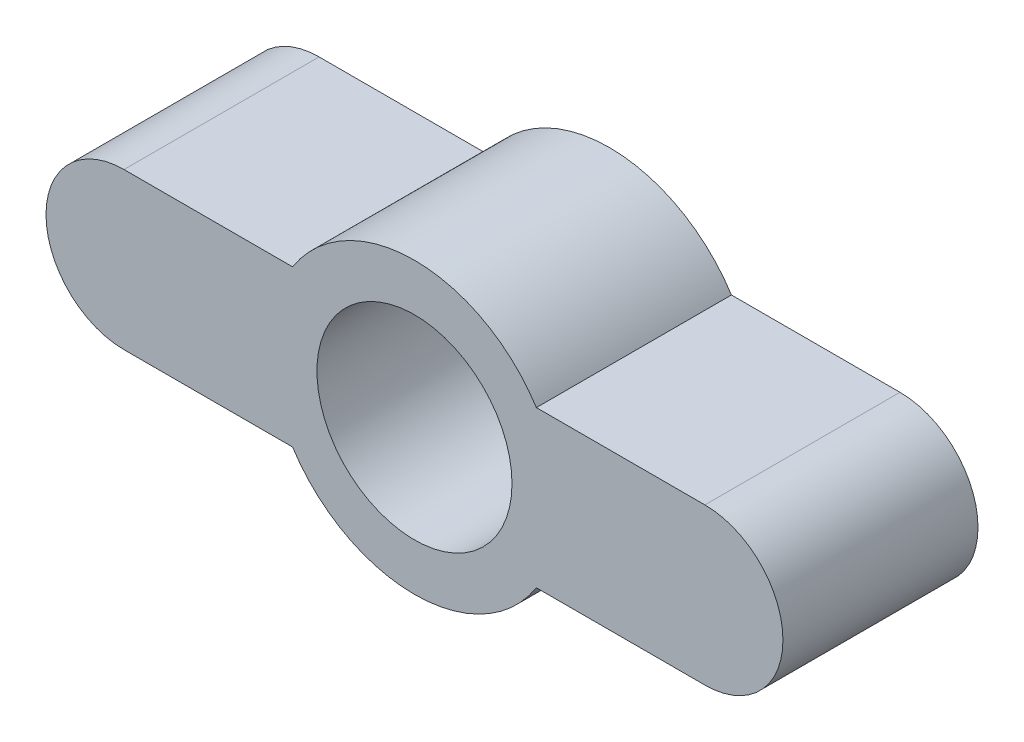
ISO-10303-21;
HEADER;
FILE_DESCRIPTION(('STEP AP214'),'2;1');
FILE_NAME('part.step','',(''),(''),'','','');
FILE_SCHEMA(('AUTOMOTIVE_DESIGN { 1 0 10303 214 1 1 1 1 }'));
ENDSEC;
DATA;
#1=APPLICATION_CONTEXT('core data for automotive mechanical design processes');
#2=APPLICATION_PROTOCOL_DEFINITION('international standard','automotive_design',2000,#1);
#3=PRODUCT_CONTEXT('',#1,'mechanical');
#4=PRODUCT('Part','Part','',(#3));
#5=PRODUCT_RELATED_PRODUCT_CATEGORY('part','',(#4));
#6=PRODUCT_DEFINITION_FORMATION('','',#4);
#7=PRODUCT_DEFINITION_CONTEXT('part definition',#1,'design');
#8=PRODUCT_DEFINITION('design','',#6,#7);
#9=PRODUCT_DEFINITION_SHAPE('','',#8);
#10=(LENGTH_UNIT() NAMED_UNIT(*) SI_UNIT(.MILLI.,.METRE.));
#11=(NAMED_UNIT(*) PLANE_ANGLE_UNIT() SI_UNIT($,.RADIAN.));
#12=(NAMED_UNIT(*) SI_UNIT($,.STERADIAN.) SOLID_ANGLE_UNIT());
#13=UNCERTAINTY_MEASURE_WITH_UNIT(LENGTH_MEASURE(1.E-05),#10,'distance_accuracy_value','');
#14=(GEOMETRIC_REPRESENTATION_CONTEXT(3) GLOBAL_UNCERTAINTY_ASSIGNED_CONTEXT((#13)) GLOBAL_UNIT_ASSIGNED_CONTEXT((#10,
#11,#12)) REPRESENTATION_CONTEXT('',''));
#15=CARTESIAN_POINT('',(0.,0.,0.));
#16=DIRECTION('',(0.,0.,1.));
#17=DIRECTION('',(1.,0.,0.));
#18=AXIS2_PLACEMENT_3D('',#15,#16,#17);
#19=CARTESIAN_POINT('',(0.,0.,5.));
#20=DIRECTION('',(0.,0.,1.));
#21=DIRECTION('',(1.,0.,0.));
#22=AXIS2_PLACEMENT_3D('',#19,#20,#21);
#23=PLANE('',#22);
#24=CARTESIAN_POINT('',(0.,0.,5.));
#25=DIRECTION('',(0.,0.,1.));
#26=DIRECTION('',(1.,0.,0.));
#27=AXIS2_PLACEMENT_3D('',#24,#25,#26);
#28=CIRCLE('',#27,3.71000000000001);
#29=CARTESIAN_POINT('',(-3.1247559904735,-2.00000000000001,5.));
#30=VERTEX_POINT('',#29);
#31=CARTESIAN_POINT('',(3.1247559904735,-2.00000000000001,5.));
#32=VERTEX_POINT('',#31);
#33=EDGE_CURVE('E167',#30,#32,#28,.T.);
#34=ORIENTED_EDGE('',*,*,#33,.T.);
#35=DIRECTION('',(1.,0.,0.));
#36=VECTOR('',#35,1.);
#37=CARTESIAN_POINT('',(3.1247559904735,-2.00000000000001,5.));
#38=LINE('',#37,#36);
#39=CARTESIAN_POINT('',(7.44499999999999,-2.00000000000001,5.));
#40=VERTEX_POINT('',#39);
#41=EDGE_CURVE('E103',#32,#40,#38,.T.);
#42=ORIENTED_EDGE('',*,*,#41,.T.);
#43=CARTESIAN_POINT('',(7.44499999999999,0.,5.));
#44=DIRECTION('',(0.,0.,1.));
#45=DIRECTION('',(1.,0.,0.));
#46=AXIS2_PLACEMENT_3D('',#43,#44,#45);
#47=CIRCLE('',#46,2.);
#48=CARTESIAN_POINT('',(7.44499999999999,1.99999999999999,5.));
#49=VERTEX_POINT('',#48);
#50=EDGE_CURVE('E188',#40,#49,#47,.T.);
#51=ORIENTED_EDGE('',*,*,#50,.T.);
#52=DIRECTION('',(-1.,0.,0.));
#53=VECTOR('',#52,1.);
#54=CARTESIAN_POINT('',(3.1247559904735,1.99999999999999,5.));
#55=LINE('',#54,#53);
#56=CARTESIAN_POINT('',(3.1247559904735,1.99999999999999,5.));
#57=VERTEX_POINT('',#56);
#58=EDGE_CURVE('E202',#49,#57,#55,.T.);
#59=ORIENTED_EDGE('',*,*,#58,.T.);
#60=CARTESIAN_POINT('',(0.,0.,5.));
#61=DIRECTION('',(0.,0.,1.));
#62=DIRECTION('',(1.,0.,0.));
#63=AXIS2_PLACEMENT_3D('',#60,#61,#62);
#64=CIRCLE('',#63,3.71);
#65=CARTESIAN_POINT('',(-3.1247559904735,1.99999999999999,5.));
#66=VERTEX_POINT('',#65);
#67=EDGE_CURVE('E122',#57,#66,#64,.T.);
#68=ORIENTED_EDGE('',*,*,#67,.T.);
#69=DIRECTION('',(-1.,0.,0.));
#70=VECTOR('',#69,1.);
#71=CARTESIAN_POINT('',(-3.1247559904735,1.99999999999999,5.));
#72=LINE('',#71,#70);
#73=CARTESIAN_POINT('',(-7.44499999999999,1.99999999999999,5.));
#74=VERTEX_POINT('',#73);
#75=EDGE_CURVE('E116',#66,#74,#72,.T.);
#76=ORIENTED_EDGE('',*,*,#75,.T.);
#77=CARTESIAN_POINT('',(-7.44499999999999,0.,5.));
#78=DIRECTION('',(0.,0.,1.));
#79=DIRECTION('',(1.,0.,0.));
#80=AXIS2_PLACEMENT_3D('',#77,#78,#79);
#81=CIRCLE('',#80,2.);
#82=CARTESIAN_POINT('',(-7.44499999999999,-2.00000000000001,5.));
#83=VERTEX_POINT('',#82);
#84=EDGE_CURVE('E120',#74,#83,#81,.T.);
#85=ORIENTED_EDGE('',*,*,#84,.T.);
#86=DIRECTION('',(1.,0.,0.));
#87=VECTOR('',#86,1.);
#88=CARTESIAN_POINT('',(-3.1247559904735,-2.00000000000001,5.));
#89=LINE('',#88,#87);
#90=EDGE_CURVE('E60',#83,#30,#89,.T.);
#91=ORIENTED_EDGE('',*,*,#90,.T.);
#92=EDGE_LOOP('',(#34,#42,#51,#59,#68,#76,#85,#91));
#93=FACE_BOUND('',#92,.T.);
#94=CARTESIAN_POINT('',(0.,0.,5.));
#95=DIRECTION('',(0.,0.,1.));
#96=DIRECTION('',(1.,0.,0.));
#97=AXIS2_PLACEMENT_3D('',#94,#95,#96);
#98=CIRCLE('',#97,2.5);
#99=CARTESIAN_POINT('',(2.5,0.,5.));
#100=VERTEX_POINT('',#99);
#101=EDGE_CURVE('E149',#100,#100,#98,.T.);
#102=ORIENTED_EDGE('',*,*,#101,.F.);
#103=EDGE_LOOP('',(#102));
#104=FACE_BOUND('',#103,.T.);
#105=ADVANCED_FACE('F42',(#93,#104),#23,.T.);
#106=CARTESIAN_POINT('',(0.,0.,0.));
#107=DIRECTION('',(0.,0.,1.));
#108=DIRECTION('',(1.,0.,0.));
#109=AXIS2_PLACEMENT_3D('',#106,#107,#108);
#110=PLANE('',#109);
#111=CARTESIAN_POINT('',(0.,0.,0.));
#112=DIRECTION('',(0.,0.,1.));
#113=DIRECTION('',(1.,0.,0.));
#114=AXIS2_PLACEMENT_3D('',#111,#112,#113);
#115=CIRCLE('',#114,3.71000000000001);
#116=CARTESIAN_POINT('',(-3.1247559904735,-2.00000000000001,0.));
#117=VERTEX_POINT('',#116);
#118=CARTESIAN_POINT('',(3.1247559904735,-2.00000000000001,0.));
#119=VERTEX_POINT('',#118);
#120=EDGE_CURVE('E144',#117,#119,#115,.T.);
#121=ORIENTED_EDGE('',*,*,#120,.F.);
#122=DIRECTION('',(1.,0.,0.));
#123=VECTOR('',#122,1.);
#124=CARTESIAN_POINT('',(-3.1247559904735,-2.00000000000001,0.));
#125=LINE('',#124,#123);
#126=CARTESIAN_POINT('',(-7.44499999999999,-2.00000000000001,0.));
#127=VERTEX_POINT('',#126);
#128=EDGE_CURVE('E95',#127,#117,#125,.T.);
#129=ORIENTED_EDGE('',*,*,#128,.F.);
#130=CARTESIAN_POINT('',(-7.44499999999999,0.,0.));
#131=DIRECTION('',(0.,0.,1.));
#132=DIRECTION('',(1.,0.,0.));
#133=AXIS2_PLACEMENT_3D('',#130,#131,#132);
#134=CIRCLE('',#133,2.);
#135=CARTESIAN_POINT('',(-7.44499999999999,1.99999999999999,0.));
#136=VERTEX_POINT('',#135);
#137=EDGE_CURVE('E89',#136,#127,#134,.T.);
#138=ORIENTED_EDGE('',*,*,#137,.F.);
#139=DIRECTION('',(-1.,0.,0.));
#140=VECTOR('',#139,1.);
#141=CARTESIAN_POINT('',(-3.1247559904735,1.99999999999999,0.));
#142=LINE('',#141,#140);
#143=CARTESIAN_POINT('',(-3.1247559904735,1.99999999999999,0.));
#144=VERTEX_POINT('',#143);
#145=EDGE_CURVE('E131',#144,#136,#142,.T.);
#146=ORIENTED_EDGE('',*,*,#145,.F.);
#147=CARTESIAN_POINT('',(0.,0.,0.));
#148=DIRECTION('',(0.,0.,1.));
#149=DIRECTION('',(1.,0.,0.));
#150=AXIS2_PLACEMENT_3D('',#147,#148,#149);
#151=CIRCLE('',#150,3.71);
#152=CARTESIAN_POINT('',(3.1247559904735,1.99999999999999,0.));
#153=VERTEX_POINT('',#152);
#154=EDGE_CURVE('E158',#153,#144,#151,.T.);
#155=ORIENTED_EDGE('',*,*,#154,.F.);
#156=DIRECTION('',(-1.,0.,0.));
#157=VECTOR('',#156,1.);
#158=CARTESIAN_POINT('',(3.1247559904735,1.99999999999999,0.));
#159=LINE('',#158,#157);
#160=CARTESIAN_POINT('',(7.44499999999999,1.99999999999999,0.));
#161=VERTEX_POINT('',#160);
#162=EDGE_CURVE('E155',#161,#153,#159,.T.);
#163=ORIENTED_EDGE('',*,*,#162,.F.);
#164=CARTESIAN_POINT('',(7.44499999999999,0.,0.));
#165=DIRECTION('',(0.,0.,1.));
#166=DIRECTION('',(1.,0.,0.));
#167=AXIS2_PLACEMENT_3D('',#164,#165,#166);
#168=CIRCLE('',#167,2.);
#169=CARTESIAN_POINT('',(7.44499999999999,-2.00000000000001,0.));
#170=VERTEX_POINT('',#169);
#171=EDGE_CURVE('E152',#170,#161,#168,.T.);
#172=ORIENTED_EDGE('',*,*,#171,.F.);
#173=DIRECTION('',(1.,0.,0.));
#174=VECTOR('',#173,1.);
#175=CARTESIAN_POINT('',(3.1247559904735,-2.00000000000001,0.));
#176=LINE('',#175,#174);
#177=EDGE_CURVE('E148',#119,#170,#176,.T.);
#178=ORIENTED_EDGE('',*,*,#177,.F.);
#179=EDGE_LOOP('',(#121,#129,#138,#146,#155,#163,#172,#178));
#180=FACE_BOUND('',#179,.T.);
#181=CARTESIAN_POINT('',(0.,0.,0.));
#182=DIRECTION('',(0.,0.,1.));
#183=DIRECTION('',(1.,0.,0.));
#184=AXIS2_PLACEMENT_3D('',#181,#182,#183);
#185=CIRCLE('',#184,2.5);
#186=CARTESIAN_POINT('',(2.5,0.,0.));
#187=VERTEX_POINT('',#186);
#188=EDGE_CURVE('E212',#187,#187,#185,.T.);
#189=ORIENTED_EDGE('',*,*,#188,.T.);
#190=EDGE_LOOP('',(#189));
#191=FACE_BOUND('',#190,.T.);
#192=ADVANCED_FACE('F192',(#180,#191),#110,.F.);
#193=CARTESIAN_POINT('',(0.,0.,5.));
#194=DIRECTION('',(0.,0.,-1.));
#195=DIRECTION('',(-1.,0.,0.));
#196=AXIS2_PLACEMENT_3D('',#193,#194,#195);
#197=CYLINDRICAL_SURFACE('',#196,3.71000000000001);
#198=ORIENTED_EDGE('',*,*,#120,.T.);
#199=DIRECTION('',(0.,0.,-1.));
#200=VECTOR('',#199,1.);
#201=CARTESIAN_POINT('',(3.1247559904735,-2.00000000000001,5.));
#202=LINE('',#201,#200);
#203=EDGE_CURVE('E11',#32,#119,#202,.T.);
#204=ORIENTED_EDGE('',*,*,#203,.F.);
#205=ORIENTED_EDGE('',*,*,#33,.F.);
#206=DIRECTION('',(0.,0.,-1.));
#207=VECTOR('',#206,1.);
#208=CARTESIAN_POINT('',(-3.1247559904735,-2.00000000000001,5.));
#209=LINE('',#208,#207);
#210=EDGE_CURVE('E140',#30,#117,#209,.T.);
#211=ORIENTED_EDGE('',*,*,#210,.T.);
#212=EDGE_LOOP('',(#198,#204,#205,#211));
#213=FACE_BOUND('',#212,.T.);
#214=ADVANCED_FACE('F44',(#213),#197,.T.);
#215=CARTESIAN_POINT('',(3.1247559904735,-2.00000000000001,5.));
#216=DIRECTION('',(0.,1.,0.));
#217=DIRECTION('',(0.,0.,1.));
#218=AXIS2_PLACEMENT_3D('',#215,#216,#217);
#219=PLANE('',#218);
#220=ORIENTED_EDGE('',*,*,#177,.T.);
#221=DIRECTION('',(0.,0.,-1.));
#222=VECTOR('',#221,1.);
#223=CARTESIAN_POINT('',(7.44499999999999,-2.00000000000001,5.));
#224=LINE('',#223,#222);
#225=EDGE_CURVE('E52',#40,#170,#224,.T.);
#226=ORIENTED_EDGE('',*,*,#225,.F.);
#227=ORIENTED_EDGE('',*,*,#41,.F.);
#228=ORIENTED_EDGE('',*,*,#203,.T.);
#229=EDGE_LOOP('',(#220,#226,#227,#228));
#230=FACE_BOUND('',#229,.T.);
#231=ADVANCED_FACE('F242',(#230),#219,.F.);
#232=CARTESIAN_POINT('',(7.44499999999999,0.,5.));
#233=DIRECTION('',(0.,0.,-1.));
#234=DIRECTION('',(-1.,0.,0.));
#235=AXIS2_PLACEMENT_3D('',#232,#233,#234);
#236=CYLINDRICAL_SURFACE('',#235,2.);
#237=ORIENTED_EDGE('',*,*,#171,.T.);
#238=DIRECTION('',(0.,0.,-1.));
#239=VECTOR('',#238,1.);
#240=CARTESIAN_POINT('',(7.44499999999999,1.99999999999999,5.));
#241=LINE('',#240,#239);
#242=EDGE_CURVE('E178',#49,#161,#241,.T.);
#243=ORIENTED_EDGE('',*,*,#242,.F.);
#244=ORIENTED_EDGE('',*,*,#50,.F.);
#245=ORIENTED_EDGE('',*,*,#225,.T.);
#246=EDGE_LOOP('',(#237,#243,#244,#245));
#247=FACE_BOUND('',#246,.T.);
#248=ADVANCED_FACE('F186',(#247),#236,.T.);
#249=CARTESIAN_POINT('',(3.1247559904735,1.99999999999999,5.));
#250=DIRECTION('',(0.,-1.,0.));
#251=DIRECTION('',(0.,0.,-1.));
#252=AXIS2_PLACEMENT_3D('',#249,#250,#251);
#253=PLANE('',#252);
#254=ORIENTED_EDGE('',*,*,#162,.T.);
#255=DIRECTION('',(0.,0.,-1.));
#256=VECTOR('',#255,1.);
#257=CARTESIAN_POINT('',(3.1247559904735,1.99999999999999,5.));
#258=LINE('',#257,#256);
#259=EDGE_CURVE('E174',#57,#153,#258,.T.);
#260=ORIENTED_EDGE('',*,*,#259,.F.);
#261=ORIENTED_EDGE('',*,*,#58,.F.);
#262=ORIENTED_EDGE('',*,*,#242,.T.);
#263=EDGE_LOOP('',(#254,#260,#261,#262));
#264=FACE_BOUND('',#263,.T.);
#265=ADVANCED_FACE('F197',(#264),#253,.F.);
#266=CARTESIAN_POINT('',(0.,0.,5.));
#267=DIRECTION('',(0.,0.,-1.));
#268=DIRECTION('',(-1.,0.,0.));
#269=AXIS2_PLACEMENT_3D('',#266,#267,#268);
#270=CYLINDRICAL_SURFACE('',#269,3.71);
#271=ORIENTED_EDGE('',*,*,#154,.T.);
#272=DIRECTION('',(0.,0.,-1.));
#273=VECTOR('',#272,1.);
#274=CARTESIAN_POINT('',(-3.1247559904735,1.99999999999999,5.));
#275=LINE('',#274,#273);
#276=EDGE_CURVE('E133',#66,#144,#275,.T.);
#277=ORIENTED_EDGE('',*,*,#276,.F.);
#278=ORIENTED_EDGE('',*,*,#67,.F.);
#279=ORIENTED_EDGE('',*,*,#259,.T.);
#280=EDGE_LOOP('',(#271,#277,#278,#279));
#281=FACE_BOUND('',#280,.T.);
#282=ADVANCED_FACE('F200',(#281),#270,.T.);
#283=CARTESIAN_POINT('',(-3.1247559904735,1.99999999999999,5.));
#284=DIRECTION('',(0.,-1.,0.));
#285=DIRECTION('',(0.,0.,-1.));
#286=AXIS2_PLACEMENT_3D('',#283,#284,#285);
#287=PLANE('',#286);
#288=ORIENTED_EDGE('',*,*,#145,.T.);
#289=DIRECTION('',(0.,0.,-1.));
#290=VECTOR('',#289,1.);
#291=CARTESIAN_POINT('',(-7.44499999999999,1.99999999999999,5.));
#292=LINE('',#291,#290);
#293=EDGE_CURVE('E128',#74,#136,#292,.T.);
#294=ORIENTED_EDGE('',*,*,#293,.F.);
#295=ORIENTED_EDGE('',*,*,#75,.F.);
#296=ORIENTED_EDGE('',*,*,#276,.T.);
#297=EDGE_LOOP('',(#288,#294,#295,#296));
#298=FACE_BOUND('',#297,.T.);
#299=ADVANCED_FACE('F129',(#298),#287,.F.);
#300=CARTESIAN_POINT('',(-7.44499999999999,0.,5.));
#301=DIRECTION('',(0.,0.,-1.));
#302=DIRECTION('',(-1.,0.,0.));
#303=AXIS2_PLACEMENT_3D('',#300,#301,#302);
#304=CYLINDRICAL_SURFACE('',#303,2.);
#305=ORIENTED_EDGE('',*,*,#137,.T.);
#306=DIRECTION('',(0.,0.,-1.));
#307=VECTOR('',#306,1.);
#308=CARTESIAN_POINT('',(-7.44499999999999,-2.00000000000001,5.));
#309=LINE('',#308,#307);
#310=EDGE_CURVE('E134',#83,#127,#309,.T.);
#311=ORIENTED_EDGE('',*,*,#310,.F.);
#312=ORIENTED_EDGE('',*,*,#84,.F.);
#313=ORIENTED_EDGE('',*,*,#293,.T.);
#314=EDGE_LOOP('',(#305,#311,#312,#313));
#315=FACE_BOUND('',#314,.T.);
#316=ADVANCED_FACE('F136',(#315),#304,.T.);
#317=CARTESIAN_POINT('',(-3.1247559904735,-2.00000000000001,5.));
#318=DIRECTION('',(0.,1.,0.));
#319=DIRECTION('',(0.,0.,1.));
#320=AXIS2_PLACEMENT_3D('',#317,#318,#319);
#321=PLANE('',#320);
#322=ORIENTED_EDGE('',*,*,#128,.T.);
#323=ORIENTED_EDGE('',*,*,#210,.F.);
#324=ORIENTED_EDGE('',*,*,#90,.F.);
#325=ORIENTED_EDGE('',*,*,#310,.T.);
#326=EDGE_LOOP('',(#322,#323,#324,#325));
#327=FACE_BOUND('',#326,.T.);
#328=ADVANCED_FACE('F230',(#327),#321,.F.);
#329=CARTESIAN_POINT('',(0.,0.,5.));
#330=DIRECTION('',(0.,0.,-1.));
#331=DIRECTION('',(-1.,0.,0.));
#332=AXIS2_PLACEMENT_3D('',#329,#330,#331);
#333=CYLINDRICAL_SURFACE('',#332,2.5);
#334=ORIENTED_EDGE('',*,*,#101,.T.);
#335=EDGE_LOOP('',(#334));
#336=FACE_BOUND('',#335,.T.);
#337=ORIENTED_EDGE('',*,*,#188,.F.);
#338=EDGE_LOOP('',(#337));
#339=FACE_BOUND('',#338,.T.);
#340=ADVANCED_FACE('F220',(#336,#339),#333,.F.);
#341=CLOSED_SHELL('',(#105,#192,#214,#231,#248,#265,#282,#299,#316,#328,#340));
#342=MANIFOLD_SOLID_BREP('B2',#341);
#343=ADVANCED_BREP_SHAPE_REPRESENTATION('',(#18,#342),#14);
#344=SHAPE_DEFINITION_REPRESENTATION(#9,#343);
ENDSEC;
END-ISO-10303-21;
